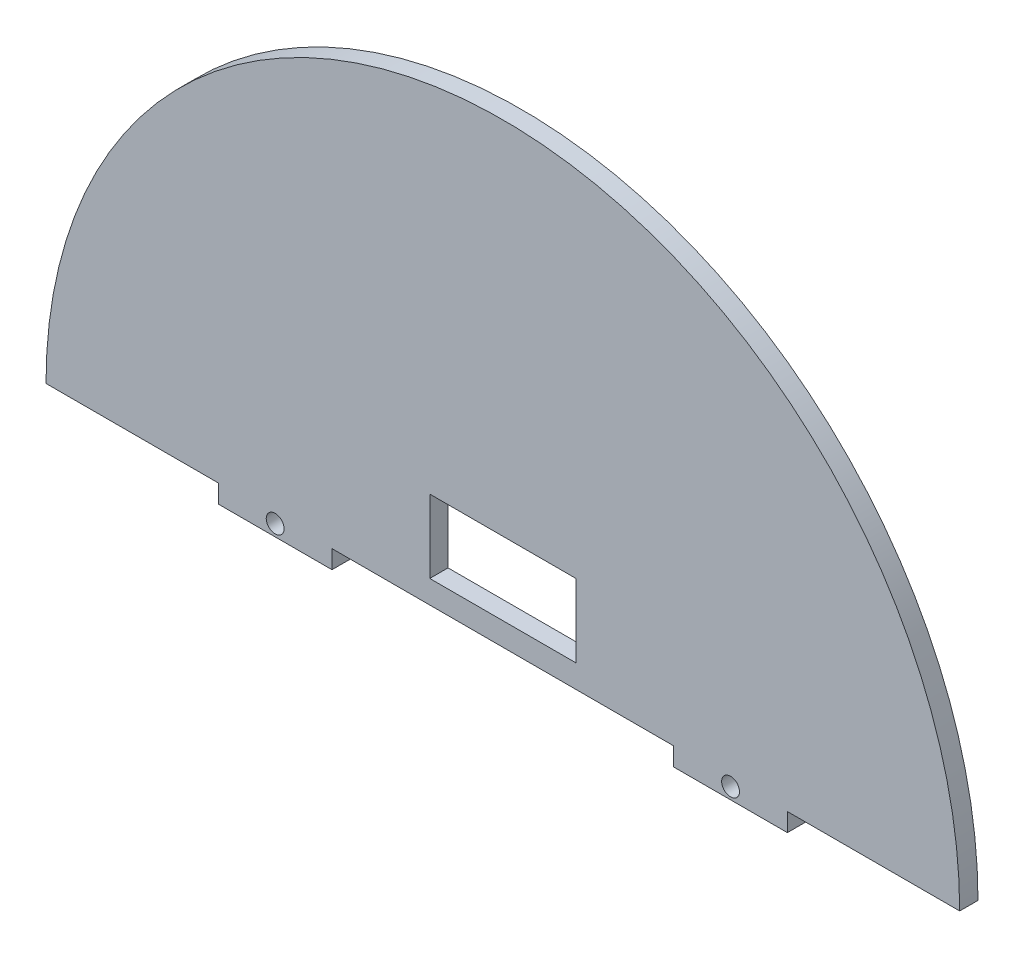
ISO-10303-21;
HEADER;
FILE_DESCRIPTION(('STEP AP214'),'2;1');
FILE_NAME('part.step','',(''),(''),'','','');
FILE_SCHEMA(('AUTOMOTIVE_DESIGN { 1 0 10303 214 1 1 1 1 }'));
ENDSEC;
DATA;
#1=APPLICATION_CONTEXT('core data for automotive mechanical design processes');
#2=APPLICATION_PROTOCOL_DEFINITION('international standard','automotive_design',2000,#1);
#3=PRODUCT_CONTEXT('',#1,'mechanical');
#4=PRODUCT('Part','Part','',(#3));
#5=PRODUCT_RELATED_PRODUCT_CATEGORY('part','',(#4));
#6=PRODUCT_DEFINITION_FORMATION('','',#4);
#7=PRODUCT_DEFINITION_CONTEXT('part definition',#1,'design');
#8=PRODUCT_DEFINITION('design','',#6,#7);
#9=PRODUCT_DEFINITION_SHAPE('','',#8);
#10=(LENGTH_UNIT() NAMED_UNIT(*) SI_UNIT(.MILLI.,.METRE.));
#11=(NAMED_UNIT(*) PLANE_ANGLE_UNIT() SI_UNIT($,.RADIAN.));
#12=(NAMED_UNIT(*) SI_UNIT($,.STERADIAN.) SOLID_ANGLE_UNIT());
#13=UNCERTAINTY_MEASURE_WITH_UNIT(LENGTH_MEASURE(1.E-05),#10,'distance_accuracy_value','');
#14=(GEOMETRIC_REPRESENTATION_CONTEXT(3) GLOBAL_UNCERTAINTY_ASSIGNED_CONTEXT((#13)) GLOBAL_UNIT_ASSIGNED_CONTEXT((#10,
#11,#12)) REPRESENTATION_CONTEXT('',''));
#15=CARTESIAN_POINT('',(0.,0.,0.));
#16=DIRECTION('',(0.,0.,1.));
#17=DIRECTION('',(1.,0.,0.));
#18=AXIS2_PLACEMENT_3D('',#15,#16,#17);
#19=CARTESIAN_POINT('',(12.7,0.,1.59));
#20=DIRECTION('',(1.,0.,0.));
#21=DIRECTION('',(0.,1.,0.));
#22=AXIS2_PLACEMENT_3D('',#19,#20,#21);
#23=PLANE('',#22);
#24=DIRECTION('',(0.,-1.,0.));
#25=VECTOR('',#24,1.);
#26=CARTESIAN_POINT('',(12.7,0.,-1.59));
#27=LINE('',#26,#25);
#28=CARTESIAN_POINT('',(12.7,16.7,-1.59));
#29=VERTEX_POINT('',#28);
#30=CARTESIAN_POINT('',(12.7,4.,-1.59));
#31=VERTEX_POINT('',#30);
#32=EDGE_CURVE('E171',#29,#31,#27,.T.);
#33=ORIENTED_EDGE('',*,*,#32,.T.);
#34=DIRECTION('',(0.,0.,-1.));
#35=VECTOR('',#34,1.);
#36=CARTESIAN_POINT('',(12.7,4.,1.59));
#37=LINE('',#36,#35);
#38=CARTESIAN_POINT('',(12.7,4.,1.59));
#39=VERTEX_POINT('',#38);
#40=EDGE_CURVE('E188',#39,#31,#37,.T.);
#41=ORIENTED_EDGE('',*,*,#40,.F.);
#42=DIRECTION('',(0.,-1.,0.));
#43=VECTOR('',#42,1.);
#44=CARTESIAN_POINT('',(12.7,0.,1.59));
#45=LINE('',#44,#43);
#46=CARTESIAN_POINT('',(12.7,16.7,1.59));
#47=VERTEX_POINT('',#46);
#48=EDGE_CURVE('E243',#47,#39,#45,.T.);
#49=ORIENTED_EDGE('',*,*,#48,.F.);
#50=DIRECTION('',(0.,0.,-1.));
#51=VECTOR('',#50,1.);
#52=CARTESIAN_POINT('',(12.7,16.7,1.59));
#53=LINE('',#52,#51);
#54=EDGE_CURVE('E191',#47,#29,#53,.T.);
#55=ORIENTED_EDGE('',*,*,#54,.T.);
#56=EDGE_LOOP('',(#33,#41,#49,#55));
#57=FACE_BOUND('',#56,.T.);
#58=ADVANCED_FACE('F75',(#57),#23,.F.);
#59=CARTESIAN_POINT('',(0.,4.,1.59));
#60=DIRECTION('',(0.,1.,0.));
#61=DIRECTION('',(0.,0.,1.));
#62=AXIS2_PLACEMENT_3D('',#59,#60,#61);
#63=PLANE('',#62);
#64=DIRECTION('',(1.,0.,0.));
#65=VECTOR('',#64,1.);
#66=CARTESIAN_POINT('',(0.,4.,-1.59));
#67=LINE('',#66,#65);
#68=CARTESIAN_POINT('',(-12.7,4.,-1.59));
#69=VERTEX_POINT('',#68);
#70=EDGE_CURVE('E174',#69,#31,#67,.T.);
#71=ORIENTED_EDGE('',*,*,#70,.F.);
#72=DIRECTION('',(0.,0.,-1.));
#73=VECTOR('',#72,1.);
#74=CARTESIAN_POINT('',(-12.7,4.,1.59));
#75=LINE('',#74,#73);
#76=CARTESIAN_POINT('',(-12.7,4.,1.59));
#77=VERTEX_POINT('',#76);
#78=EDGE_CURVE('E184',#77,#69,#75,.T.);
#79=ORIENTED_EDGE('',*,*,#78,.F.);
#80=DIRECTION('',(1.,0.,0.));
#81=VECTOR('',#80,1.);
#82=CARTESIAN_POINT('',(0.,4.,1.59));
#83=LINE('',#82,#81);
#84=EDGE_CURVE('E245',#77,#39,#83,.T.);
#85=ORIENTED_EDGE('',*,*,#84,.T.);
#86=ORIENTED_EDGE('',*,*,#40,.T.);
#87=EDGE_LOOP('',(#71,#79,#85,#86));
#88=FACE_BOUND('',#87,.T.);
#89=ADVANCED_FACE('F324',(#88),#63,.T.);
#90=CARTESIAN_POINT('',(-12.7,0.,1.59));
#91=DIRECTION('',(1.,0.,0.));
#92=DIRECTION('',(0.,0.,-1.));
#93=AXIS2_PLACEMENT_3D('',#90,#91,#92);
#94=PLANE('',#93);
#95=DIRECTION('',(0.,-1.,0.));
#96=VECTOR('',#95,1.);
#97=CARTESIAN_POINT('',(-12.7,0.,-1.59));
#98=LINE('',#97,#96);
#99=CARTESIAN_POINT('',(-12.7,16.7,-1.59));
#100=VERTEX_POINT('',#99);
#101=EDGE_CURVE('E177',#100,#69,#98,.T.);
#102=ORIENTED_EDGE('',*,*,#101,.F.);
#103=DIRECTION('',(0.,0.,-1.));
#104=VECTOR('',#103,1.);
#105=CARTESIAN_POINT('',(-12.7,16.7,1.59));
#106=LINE('',#105,#104);
#107=CARTESIAN_POINT('',(-12.7,16.7,1.59));
#108=VERTEX_POINT('',#107);
#109=EDGE_CURVE('E181',#108,#100,#106,.T.);
#110=ORIENTED_EDGE('',*,*,#109,.F.);
#111=DIRECTION('',(0.,-1.,0.));
#112=VECTOR('',#111,1.);
#113=CARTESIAN_POINT('',(-12.7,0.,1.59));
#114=LINE('',#113,#112);
#115=EDGE_CURVE('E154',#108,#77,#114,.T.);
#116=ORIENTED_EDGE('',*,*,#115,.T.);
#117=ORIENTED_EDGE('',*,*,#78,.T.);
#118=EDGE_LOOP('',(#102,#110,#116,#117));
#119=FACE_BOUND('',#118,.T.);
#120=ADVANCED_FACE('F257',(#119),#94,.T.);
#121=CARTESIAN_POINT('',(0.,16.7,1.59));
#122=DIRECTION('',(0.,1.,0.));
#123=DIRECTION('',(0.,0.,1.));
#124=AXIS2_PLACEMENT_3D('',#121,#122,#123);
#125=PLANE('',#124);
#126=DIRECTION('',(1.,0.,0.));
#127=VECTOR('',#126,1.);
#128=CARTESIAN_POINT('',(0.,16.7,-1.59));
#129=LINE('',#128,#127);
#130=EDGE_CURVE('E168',#100,#29,#129,.T.);
#131=ORIENTED_EDGE('',*,*,#130,.T.);
#132=ORIENTED_EDGE('',*,*,#54,.F.);
#133=DIRECTION('',(1.,0.,0.));
#134=VECTOR('',#133,1.);
#135=CARTESIAN_POINT('',(0.,16.7,1.59));
#136=LINE('',#135,#134);
#137=EDGE_CURVE('E240',#108,#47,#136,.T.);
#138=ORIENTED_EDGE('',*,*,#137,.F.);
#139=ORIENTED_EDGE('',*,*,#109,.T.);
#140=EDGE_LOOP('',(#131,#132,#138,#139));
#141=FACE_BOUND('',#140,.T.);
#142=ADVANCED_FACE('F327',(#141),#125,.F.);
#143=CARTESIAN_POINT('',(0.,0.,1.59));
#144=DIRECTION('',(0.,1.,0.));
#145=DIRECTION('',(0.,0.,1.));
#146=AXIS2_PLACEMENT_3D('',#143,#144,#145);
#147=PLANE('',#146);
#148=DIRECTION('',(1.,0.,0.));
#149=VECTOR('',#148,1.);
#150=CARTESIAN_POINT('',(0.,0.,-1.59));
#151=LINE('',#150,#149);
#152=CARTESIAN_POINT('',(49.44,0.,-1.59));
#153=VERTEX_POINT('',#152);
#154=CARTESIAN_POINT('',(79.38,0.,-1.59));
#155=VERTEX_POINT('',#154);
#156=EDGE_CURVE('E143',#153,#155,#151,.T.);
#157=ORIENTED_EDGE('',*,*,#156,.T.);
#158=DIRECTION('',(0.,0.,-1.));
#159=VECTOR('',#158,1.);
#160=CARTESIAN_POINT('',(79.38,0.,1.59));
#161=LINE('',#160,#159);
#162=CARTESIAN_POINT('',(79.38,0.,1.59));
#163=VERTEX_POINT('',#162);
#164=EDGE_CURVE('E206',#163,#155,#161,.T.);
#165=ORIENTED_EDGE('',*,*,#164,.F.);
#166=DIRECTION('',(1.,0.,0.));
#167=VECTOR('',#166,1.);
#168=CARTESIAN_POINT('',(0.,0.,1.59));
#169=LINE('',#168,#167);
#170=CARTESIAN_POINT('',(49.44,0.,1.59));
#171=VERTEX_POINT('',#170);
#172=EDGE_CURVE('E223',#171,#163,#169,.T.);
#173=ORIENTED_EDGE('',*,*,#172,.F.);
#174=DIRECTION('',(0.,0.,-1.));
#175=VECTOR('',#174,1.);
#176=CARTESIAN_POINT('',(49.44,0.,1.59));
#177=LINE('',#176,#175);
#178=EDGE_CURVE('E185',#171,#153,#177,.T.);
#179=ORIENTED_EDGE('',*,*,#178,.T.);
#180=EDGE_LOOP('',(#157,#165,#173,#179));
#181=FACE_BOUND('',#180,.T.);
#182=ADVANCED_FACE('F329',(#181),#147,.F.);
#183=CARTESIAN_POINT('',(0.,0.,1.59));
#184=DIRECTION('',(0.,0.,-1.));
#185=DIRECTION('',(-1.,0.,0.));
#186=AXIS2_PLACEMENT_3D('',#183,#184,#185);
#187=CYLINDRICAL_SURFACE('',#186,79.38);
#188=CARTESIAN_POINT('',(0.,0.,-1.59));
#189=DIRECTION('',(0.,0.,1.));
#190=DIRECTION('',(1.,0.,0.));
#191=AXIS2_PLACEMENT_3D('',#188,#189,#190);
#192=CIRCLE('',#191,79.38);
#193=CARTESIAN_POINT('',(-79.38,0.,-1.59));
#194=VERTEX_POINT('',#193);
#195=EDGE_CURVE('E150',#155,#194,#192,.T.);
#196=ORIENTED_EDGE('',*,*,#195,.T.);
#197=DIRECTION('',(0.,0.,-1.));
#198=VECTOR('',#197,1.);
#199=CARTESIAN_POINT('',(-79.38,0.,1.59));
#200=LINE('',#199,#198);
#201=CARTESIAN_POINT('',(-79.38,0.,1.59));
#202=VERTEX_POINT('',#201);
#203=EDGE_CURVE('E203',#202,#194,#200,.T.);
#204=ORIENTED_EDGE('',*,*,#203,.F.);
#205=CARTESIAN_POINT('',(0.,0.,1.59));
#206=DIRECTION('',(0.,0.,1.));
#207=DIRECTION('',(1.,0.,0.));
#208=AXIS2_PLACEMENT_3D('',#205,#206,#207);
#209=CIRCLE('',#208,79.38);
#210=EDGE_CURVE('E226',#163,#202,#209,.T.);
#211=ORIENTED_EDGE('',*,*,#210,.F.);
#212=ORIENTED_EDGE('',*,*,#164,.T.);
#213=EDGE_LOOP('',(#196,#204,#211,#212));
#214=FACE_BOUND('',#213,.T.);
#215=ADVANCED_FACE('F335',(#214),#187,.T.);
#216=DIRECTION('',(0.,0.,-1.));
#217=VECTOR('',#216,1.);
#218=CARTESIAN_POINT('',(-49.44,0.,1.59));
#219=LINE('',#218,#217);
#220=CARTESIAN_POINT('',(-49.44,0.,1.59));
#221=VERTEX_POINT('',#220);
#222=CARTESIAN_POINT('',(-49.44,0.,-1.59));
#223=VERTEX_POINT('',#222);
#224=EDGE_CURVE('E12',#221,#223,#219,.T.);
#225=ORIENTED_EDGE('',*,*,#224,.F.);
#226=EDGE_CURVE('E228',#202,#221,#169,.T.);
#227=ORIENTED_EDGE('',*,*,#226,.F.);
#228=ORIENTED_EDGE('',*,*,#203,.T.);
#229=EDGE_CURVE('E152',#194,#223,#151,.T.);
#230=ORIENTED_EDGE('',*,*,#229,.T.);
#231=EDGE_LOOP('',(#225,#227,#228,#230));
#232=FACE_BOUND('',#231,.T.);
#233=ADVANCED_FACE('F296',(#232),#147,.F.);
#234=CARTESIAN_POINT('',(-39.565,-1.18,1.59));
#235=DIRECTION('',(0.,0.,-1.));
#236=DIRECTION('',(-1.,0.,0.));
#237=AXIS2_PLACEMENT_3D('',#234,#235,#236);
#238=CYLINDRICAL_SURFACE('',#237,1.55);
#239=CARTESIAN_POINT('',(-39.565,-1.18,-1.59));
#240=DIRECTION('',(0.,0.,1.));
#241=DIRECTION('',(1.,0.,0.));
#242=AXIS2_PLACEMENT_3D('',#239,#240,#241);
#243=CIRCLE('',#242,1.55);
#244=CARTESIAN_POINT('',(-38.015,-1.18,-1.59));
#245=VERTEX_POINT('',#244);
#246=EDGE_CURVE('E159',#245,#245,#243,.T.);
#247=ORIENTED_EDGE('',*,*,#246,.F.);
#248=EDGE_LOOP('',(#247));
#249=FACE_BOUND('',#248,.T.);
#250=CARTESIAN_POINT('',(-39.565,-1.18,1.59));
#251=DIRECTION('',(0.,0.,1.));
#252=DIRECTION('',(1.,0.,0.));
#253=AXIS2_PLACEMENT_3D('',#250,#251,#252);
#254=CIRCLE('',#253,1.55);
#255=CARTESIAN_POINT('',(-38.015,-1.18,1.59));
#256=VERTEX_POINT('',#255);
#257=EDGE_CURVE('E231',#256,#256,#254,.T.);
#258=ORIENTED_EDGE('',*,*,#257,.T.);
#259=EDGE_LOOP('',(#258));
#260=FACE_BOUND('',#259,.T.);
#261=ADVANCED_FACE('F364',(#249,#260),#238,.F.);
#262=CARTESIAN_POINT('',(-29.69,0.,1.59));
#263=VERTEX_POINT('',#262);
#264=CARTESIAN_POINT('',(29.69,0.,1.59));
#265=VERTEX_POINT('',#264);
#266=EDGE_CURVE('E227',#263,#265,#169,.T.);
#267=ORIENTED_EDGE('',*,*,#266,.F.);
#268=DIRECTION('',(0.,0.,-1.));
#269=VECTOR('',#268,1.);
#270=CARTESIAN_POINT('',(-29.69,0.,1.59));
#271=LINE('',#270,#269);
#272=CARTESIAN_POINT('',(-29.69,0.,-1.59));
#273=VERTEX_POINT('',#272);
#274=EDGE_CURVE('E85',#263,#273,#271,.T.);
#275=ORIENTED_EDGE('',*,*,#274,.T.);
#276=CARTESIAN_POINT('',(29.69,0.,-1.59));
#277=VERTEX_POINT('',#276);
#278=EDGE_CURVE('E135',#273,#277,#151,.T.);
#279=ORIENTED_EDGE('',*,*,#278,.T.);
#280=DIRECTION('',(0.,0.,-1.));
#281=VECTOR('',#280,1.);
#282=CARTESIAN_POINT('',(29.69,0.,1.59));
#283=LINE('',#282,#281);
#284=EDGE_CURVE('E200',#265,#277,#283,.T.);
#285=ORIENTED_EDGE('',*,*,#284,.F.);
#286=EDGE_LOOP('',(#267,#275,#279,#285));
#287=FACE_BOUND('',#286,.T.);
#288=ADVANCED_FACE('F301',(#287),#147,.F.);
#289=CARTESIAN_POINT('',(29.69,0.,1.59));
#290=DIRECTION('',(1.,0.,0.));
#291=DIRECTION('',(0.,0.,-1.));
#292=AXIS2_PLACEMENT_3D('',#289,#290,#291);
#293=PLANE('',#292);
#294=DIRECTION('',(0.,-1.,0.));
#295=VECTOR('',#294,1.);
#296=CARTESIAN_POINT('',(29.69,0.,-1.59));
#297=LINE('',#296,#295);
#298=CARTESIAN_POINT('',(29.69,-3.18,-1.59));
#299=VERTEX_POINT('',#298);
#300=EDGE_CURVE('E162',#277,#299,#297,.T.);
#301=ORIENTED_EDGE('',*,*,#300,.T.);
#302=DIRECTION('',(0.,0.,-1.));
#303=VECTOR('',#302,1.);
#304=CARTESIAN_POINT('',(29.69,-3.18,1.59));
#305=LINE('',#304,#303);
#306=CARTESIAN_POINT('',(29.69,-3.18,1.59));
#307=VERTEX_POINT('',#306);
#308=EDGE_CURVE('E197',#307,#299,#305,.T.);
#309=ORIENTED_EDGE('',*,*,#308,.F.);
#310=DIRECTION('',(0.,-1.,0.));
#311=VECTOR('',#310,1.);
#312=CARTESIAN_POINT('',(29.69,0.,1.59));
#313=LINE('',#312,#311);
#314=EDGE_CURVE('E234',#265,#307,#313,.T.);
#315=ORIENTED_EDGE('',*,*,#314,.F.);
#316=ORIENTED_EDGE('',*,*,#284,.T.);
#317=EDGE_LOOP('',(#301,#309,#315,#316));
#318=FACE_BOUND('',#317,.T.);
#319=ADVANCED_FACE('F305',(#318),#293,.F.);
#320=CARTESIAN_POINT('',(0.,-3.18,1.59));
#321=DIRECTION('',(0.,1.,0.));
#322=DIRECTION('',(0.,0.,1.));
#323=AXIS2_PLACEMENT_3D('',#320,#321,#322);
#324=PLANE('',#323);
#325=DIRECTION('',(1.,0.,0.));
#326=VECTOR('',#325,1.);
#327=CARTESIAN_POINT('',(0.,-3.18,-1.59));
#328=LINE('',#327,#326);
#329=CARTESIAN_POINT('',(49.44,-3.18,-1.59));
#330=VERTEX_POINT('',#329);
#331=EDGE_CURVE('E165',#299,#330,#328,.T.);
#332=ORIENTED_EDGE('',*,*,#331,.T.);
#333=DIRECTION('',(0.,0.,-1.));
#334=VECTOR('',#333,1.);
#335=CARTESIAN_POINT('',(49.44,-3.18,1.59));
#336=LINE('',#335,#334);
#337=CARTESIAN_POINT('',(49.44,-3.18,1.59));
#338=VERTEX_POINT('',#337);
#339=EDGE_CURVE('E194',#338,#330,#336,.T.);
#340=ORIENTED_EDGE('',*,*,#339,.F.);
#341=DIRECTION('',(1.,0.,0.));
#342=VECTOR('',#341,1.);
#343=CARTESIAN_POINT('',(0.,-3.18,1.59));
#344=LINE('',#343,#342);
#345=EDGE_CURVE('E237',#307,#338,#344,.T.);
#346=ORIENTED_EDGE('',*,*,#345,.F.);
#347=ORIENTED_EDGE('',*,*,#308,.T.);
#348=EDGE_LOOP('',(#332,#340,#346,#347));
#349=FACE_BOUND('',#348,.T.);
#350=ADVANCED_FACE('F309',(#349),#324,.F.);
#351=CARTESIAN_POINT('',(49.44,0.,1.59));
#352=DIRECTION('',(1.,0.,0.));
#353=DIRECTION('',(0.,0.,-1.));
#354=AXIS2_PLACEMENT_3D('',#351,#352,#353);
#355=PLANE('',#354);
#356=DIRECTION('',(0.,-1.,0.));
#357=VECTOR('',#356,1.);
#358=CARTESIAN_POINT('',(49.44,0.,-1.59));
#359=LINE('',#358,#357);
#360=EDGE_CURVE('E142',#153,#330,#359,.T.);
#361=ORIENTED_EDGE('',*,*,#360,.F.);
#362=ORIENTED_EDGE('',*,*,#178,.F.);
#363=DIRECTION('',(0.,-1.,0.));
#364=VECTOR('',#363,1.);
#365=CARTESIAN_POINT('',(49.44,0.,1.59));
#366=LINE('',#365,#364);
#367=EDGE_CURVE('E180',#171,#338,#366,.T.);
#368=ORIENTED_EDGE('',*,*,#367,.T.);
#369=ORIENTED_EDGE('',*,*,#339,.T.);
#370=EDGE_LOOP('',(#361,#362,#368,#369));
#371=FACE_BOUND('',#370,.T.);
#372=ADVANCED_FACE('F357',(#371),#355,.T.);
#373=CARTESIAN_POINT('',(0.,0.,-1.59));
#374=DIRECTION('',(0.,0.,1.));
#375=DIRECTION('',(1.,0.,0.));
#376=AXIS2_PLACEMENT_3D('',#373,#374,#375);
#377=PLANE('',#376);
#378=CARTESIAN_POINT('',(39.565,-1.18,-1.59));
#379=DIRECTION('',(0.,0.,1.));
#380=DIRECTION('',(1.,0.,0.));
#381=AXIS2_PLACEMENT_3D('',#378,#379,#380);
#382=CIRCLE('',#381,1.55);
#383=CARTESIAN_POINT('',(41.115,-1.18,-1.59));
#384=VERTEX_POINT('',#383);
#385=EDGE_CURVE('E213',#384,#384,#382,.F.);
#386=ORIENTED_EDGE('',*,*,#385,.F.);
#387=EDGE_LOOP('',(#386));
#388=FACE_BOUND('',#387,.T.);
#389=ORIENTED_EDGE('',*,*,#246,.T.);
#390=EDGE_LOOP('',(#389));
#391=FACE_BOUND('',#390,.T.);
#392=ORIENTED_EDGE('',*,*,#360,.T.);
#393=ORIENTED_EDGE('',*,*,#331,.F.);
#394=ORIENTED_EDGE('',*,*,#300,.F.);
#395=ORIENTED_EDGE('',*,*,#278,.F.);
#396=DIRECTION('',(0.,-1.,0.));
#397=VECTOR('',#396,1.);
#398=CARTESIAN_POINT('',(-29.69,0.,-1.59));
#399=LINE('',#398,#397);
#400=CARTESIAN_POINT('',(-29.69,-3.18,-1.59));
#401=VERTEX_POINT('',#400);
#402=EDGE_CURVE('E119',#273,#401,#399,.T.);
#403=ORIENTED_EDGE('',*,*,#402,.T.);
#404=DIRECTION('',(1.,0.,0.));
#405=VECTOR('',#404,1.);
#406=CARTESIAN_POINT('',(-49.44,-3.18,-1.59));
#407=LINE('',#406,#405);
#408=CARTESIAN_POINT('',(-49.44,-3.18,-1.59));
#409=VERTEX_POINT('',#408);
#410=EDGE_CURVE('E112',#409,#401,#407,.T.);
#411=ORIENTED_EDGE('',*,*,#410,.F.);
#412=DIRECTION('',(0.,-1.,0.));
#413=VECTOR('',#412,1.);
#414=CARTESIAN_POINT('',(-49.44,0.,-1.59));
#415=LINE('',#414,#413);
#416=EDGE_CURVE('E128',#223,#409,#415,.T.);
#417=ORIENTED_EDGE('',*,*,#416,.F.);
#418=ORIENTED_EDGE('',*,*,#229,.F.);
#419=ORIENTED_EDGE('',*,*,#195,.F.);
#420=ORIENTED_EDGE('',*,*,#156,.F.);
#421=EDGE_LOOP('',(#392,#393,#394,#395,#403,#411,#417,#418,#419,#420));
#422=FACE_BOUND('',#421,.T.);
#423=ORIENTED_EDGE('',*,*,#130,.F.);
#424=ORIENTED_EDGE('',*,*,#101,.T.);
#425=ORIENTED_EDGE('',*,*,#70,.T.);
#426=ORIENTED_EDGE('',*,*,#32,.F.);
#427=EDGE_LOOP('',(#423,#424,#425,#426));
#428=FACE_BOUND('',#427,.T.);
#429=ADVANCED_FACE('F131',(#388,#391,#422,#428),#377,.F.);
#430=CARTESIAN_POINT('',(0.,0.,1.59));
#431=DIRECTION('',(0.,0.,1.));
#432=DIRECTION('',(1.,0.,0.));
#433=AXIS2_PLACEMENT_3D('',#430,#431,#432);
#434=PLANE('',#433);
#435=CARTESIAN_POINT('',(39.565,-1.18,1.59));
#436=DIRECTION('',(0.,0.,1.));
#437=DIRECTION('',(1.,0.,0.));
#438=AXIS2_PLACEMENT_3D('',#435,#436,#437);
#439=CIRCLE('',#438,1.55);
#440=CARTESIAN_POINT('',(41.115,-1.18,1.59));
#441=VERTEX_POINT('',#440);
#442=EDGE_CURVE('E79',#441,#441,#439,.F.);
#443=ORIENTED_EDGE('',*,*,#442,.T.);
#444=EDGE_LOOP('',(#443));
#445=FACE_BOUND('',#444,.T.);
#446=ORIENTED_EDGE('',*,*,#257,.F.);
#447=EDGE_LOOP('',(#446));
#448=FACE_BOUND('',#447,.T.);
#449=ORIENTED_EDGE('',*,*,#367,.F.);
#450=ORIENTED_EDGE('',*,*,#172,.T.);
#451=ORIENTED_EDGE('',*,*,#210,.T.);
#452=ORIENTED_EDGE('',*,*,#226,.T.);
#453=DIRECTION('',(0.,-1.,0.));
#454=VECTOR('',#453,1.);
#455=CARTESIAN_POINT('',(-49.44,0.,1.59));
#456=LINE('',#455,#454);
#457=CARTESIAN_POINT('',(-49.44,-3.18,1.59));
#458=VERTEX_POINT('',#457);
#459=EDGE_CURVE('E136',#221,#458,#456,.T.);
#460=ORIENTED_EDGE('',*,*,#459,.T.);
#461=DIRECTION('',(1.,0.,0.));
#462=VECTOR('',#461,1.);
#463=CARTESIAN_POINT('',(-49.44,-3.18,1.59));
#464=LINE('',#463,#462);
#465=CARTESIAN_POINT('',(-29.69,-3.18,1.59));
#466=VERTEX_POINT('',#465);
#467=EDGE_CURVE('E139',#458,#466,#464,.T.);
#468=ORIENTED_EDGE('',*,*,#467,.T.);
#469=DIRECTION('',(0.,-1.,0.));
#470=VECTOR('',#469,1.);
#471=CARTESIAN_POINT('',(-29.69,0.,1.59));
#472=LINE('',#471,#470);
#473=EDGE_CURVE('E121',#263,#466,#472,.T.);
#474=ORIENTED_EDGE('',*,*,#473,.F.);
#475=ORIENTED_EDGE('',*,*,#266,.T.);
#476=ORIENTED_EDGE('',*,*,#314,.T.);
#477=ORIENTED_EDGE('',*,*,#345,.T.);
#478=EDGE_LOOP('',(#449,#450,#451,#452,#460,#468,#474,#475,#476,#477));
#479=FACE_BOUND('',#478,.T.);
#480=ORIENTED_EDGE('',*,*,#137,.T.);
#481=ORIENTED_EDGE('',*,*,#48,.T.);
#482=ORIENTED_EDGE('',*,*,#84,.F.);
#483=ORIENTED_EDGE('',*,*,#115,.F.);
#484=EDGE_LOOP('',(#480,#481,#482,#483));
#485=FACE_BOUND('',#484,.T.);
#486=ADVANCED_FACE('F264',(#445,#448,#479,#485),#434,.T.);
#487=CARTESIAN_POINT('',(-49.44,-3.18,1.59));
#488=DIRECTION('',(0.,1.,0.));
#489=DIRECTION('',(0.,0.,1.));
#490=AXIS2_PLACEMENT_3D('',#487,#488,#489);
#491=PLANE('',#490);
#492=ORIENTED_EDGE('',*,*,#410,.T.);
#493=DIRECTION('',(0.,0.,-1.));
#494=VECTOR('',#493,1.);
#495=CARTESIAN_POINT('',(-29.69,-3.18,1.59));
#496=LINE('',#495,#494);
#497=EDGE_CURVE('E116',#466,#401,#496,.T.);
#498=ORIENTED_EDGE('',*,*,#497,.F.);
#499=ORIENTED_EDGE('',*,*,#467,.F.);
#500=DIRECTION('',(0.,0.,-1.));
#501=VECTOR('',#500,1.);
#502=CARTESIAN_POINT('',(-49.44,-3.18,1.59));
#503=LINE('',#502,#501);
#504=EDGE_CURVE('E123',#458,#409,#503,.T.);
#505=ORIENTED_EDGE('',*,*,#504,.T.);
#506=EDGE_LOOP('',(#492,#498,#499,#505));
#507=FACE_BOUND('',#506,.T.);
#508=ADVANCED_FACE('F125',(#507),#491,.F.);
#509=CARTESIAN_POINT('',(-29.69,0.,1.59));
#510=DIRECTION('',(1.,0.,0.));
#511=DIRECTION('',(0.,0.,-1.));
#512=AXIS2_PLACEMENT_3D('',#509,#510,#511);
#513=PLANE('',#512);
#514=ORIENTED_EDGE('',*,*,#402,.F.);
#515=ORIENTED_EDGE('',*,*,#274,.F.);
#516=ORIENTED_EDGE('',*,*,#473,.T.);
#517=ORIENTED_EDGE('',*,*,#497,.T.);
#518=EDGE_LOOP('',(#514,#515,#516,#517));
#519=FACE_BOUND('',#518,.T.);
#520=ADVANCED_FACE('F117',(#519),#513,.T.);
#521=CARTESIAN_POINT('',(-49.44,0.,1.59));
#522=DIRECTION('',(1.,0.,0.));
#523=DIRECTION('',(0.,0.,-1.));
#524=AXIS2_PLACEMENT_3D('',#521,#522,#523);
#525=PLANE('',#524);
#526=ORIENTED_EDGE('',*,*,#416,.T.);
#527=ORIENTED_EDGE('',*,*,#504,.F.);
#528=ORIENTED_EDGE('',*,*,#459,.F.);
#529=ORIENTED_EDGE('',*,*,#224,.T.);
#530=EDGE_LOOP('',(#526,#527,#528,#529));
#531=FACE_BOUND('',#530,.T.);
#532=ADVANCED_FACE('F77',(#531),#525,.F.);
#533=CARTESIAN_POINT('',(39.565,-1.18,-5.));
#534=DIRECTION('',(0.,0.,1.));
#535=DIRECTION('',(1.,0.,0.));
#536=AXIS2_PLACEMENT_3D('',#533,#534,#535);
#537=CYLINDRICAL_SURFACE('',#536,1.55);
#538=ORIENTED_EDGE('',*,*,#442,.F.);
#539=EDGE_LOOP('',(#538));
#540=FACE_BOUND('',#539,.T.);
#541=ORIENTED_EDGE('',*,*,#385,.T.);
#542=EDGE_LOOP('',(#541));
#543=FACE_BOUND('',#542,.T.);
#544=ADVANCED_FACE('F342',(#540,#543),#537,.F.);
#545=CLOSED_SHELL('',(#58,#89,#120,#142,#182,#215,#233,#261,#288,#319,#350,#372,#429,#486,#508,
#520,#532,#544));
#546=MANIFOLD_SOLID_BREP('B2',#545);
#547=ADVANCED_BREP_SHAPE_REPRESENTATION('',(#18,#546),#14);
#548=SHAPE_DEFINITION_REPRESENTATION(#9,#547);
ENDSEC;
END-ISO-10303-21;
